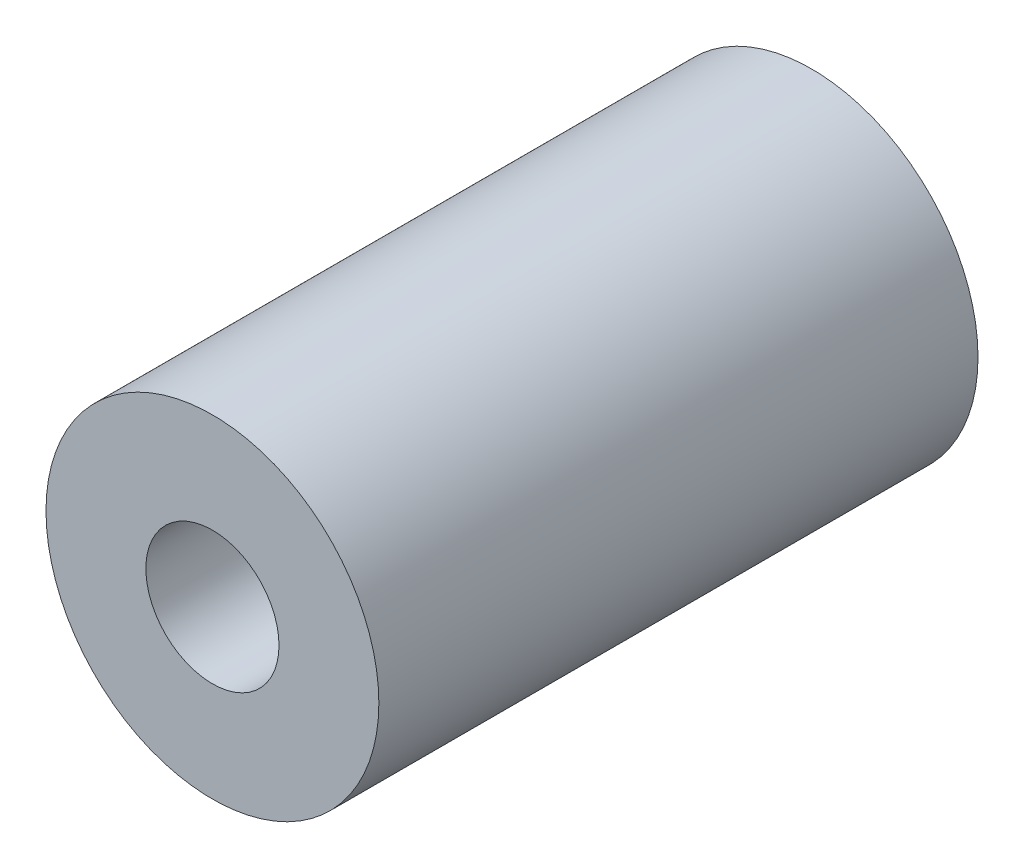
ISO-10303-21;
HEADER;
FILE_DESCRIPTION(('STEP AP214'),'2;1');
FILE_NAME('part.step','',(''),(''),'','','');
FILE_SCHEMA(('AUTOMOTIVE_DESIGN { 1 0 10303 214 1 1 1 1 }'));
ENDSEC;
DATA;
#1=APPLICATION_CONTEXT('core data for automotive mechanical design processes');
#2=APPLICATION_PROTOCOL_DEFINITION('international standard','automotive_design',2000,#1);
#3=PRODUCT_CONTEXT('',#1,'mechanical');
#4=PRODUCT('Part','Part','',(#3));
#5=PRODUCT_RELATED_PRODUCT_CATEGORY('part','',(#4));
#6=PRODUCT_DEFINITION_FORMATION('','',#4);
#7=PRODUCT_DEFINITION_CONTEXT('part definition',#1,'design');
#8=PRODUCT_DEFINITION('design','',#6,#7);
#9=PRODUCT_DEFINITION_SHAPE('','',#8);
#10=(LENGTH_UNIT() NAMED_UNIT(*) SI_UNIT(.MILLI.,.METRE.));
#11=(NAMED_UNIT(*) PLANE_ANGLE_UNIT() SI_UNIT($,.RADIAN.));
#12=(NAMED_UNIT(*) SI_UNIT($,.STERADIAN.) SOLID_ANGLE_UNIT());
#13=UNCERTAINTY_MEASURE_WITH_UNIT(LENGTH_MEASURE(1.E-05),#10,'distance_accuracy_value','');
#14=(GEOMETRIC_REPRESENTATION_CONTEXT(3) GLOBAL_UNCERTAINTY_ASSIGNED_CONTEXT((#13)) GLOBAL_UNIT_ASSIGNED_CONTEXT((#10,
#11,#12)) REPRESENTATION_CONTEXT('',''));
#15=CARTESIAN_POINT('',(0.,0.,0.));
#16=DIRECTION('',(0.,0.,1.));
#17=DIRECTION('',(1.,0.,0.));
#18=AXIS2_PLACEMENT_3D('',#15,#16,#17);
#19=CARTESIAN_POINT('',(0.,0.,54.));
#20=DIRECTION('',(0.,0.,1.));
#21=DIRECTION('',(1.,0.,0.));
#22=AXIS2_PLACEMENT_3D('',#19,#20,#21);
#23=PLANE('',#22);
#24=CARTESIAN_POINT('',(0.,0.,54.));
#25=DIRECTION('',(0.,0.,1.));
#26=DIRECTION('',(1.,0.,0.));
#27=AXIS2_PLACEMENT_3D('',#24,#25,#26);
#28=CIRCLE('',#27,15.);
#29=CARTESIAN_POINT('',(15.,0.,54.));
#30=VERTEX_POINT('',#29);
#31=EDGE_CURVE('E10',#30,#30,#28,.T.);
#32=ORIENTED_EDGE('',*,*,#31,.T.);
#33=EDGE_LOOP('',(#32));
#34=FACE_BOUND('',#33,.T.);
#35=CARTESIAN_POINT('',(0.,0.,54.));
#36=DIRECTION('',(0.,0.,1.));
#37=DIRECTION('',(1.,0.,0.));
#38=AXIS2_PLACEMENT_3D('',#35,#36,#37);
#39=CIRCLE('',#38,6.);
#40=CARTESIAN_POINT('',(6.,0.,54.));
#41=VERTEX_POINT('',#40);
#42=EDGE_CURVE('E45',#41,#41,#39,.T.);
#43=ORIENTED_EDGE('',*,*,#42,.F.);
#44=EDGE_LOOP('',(#43));
#45=FACE_BOUND('',#44,.T.);
#46=ADVANCED_FACE('F34',(#34,#45),#23,.T.);
#47=CARTESIAN_POINT('',(0.,0.,0.));
#48=DIRECTION('',(0.,0.,1.));
#49=DIRECTION('',(1.,0.,0.));
#50=AXIS2_PLACEMENT_3D('',#47,#48,#49);
#51=PLANE('',#50);
#52=CARTESIAN_POINT('',(0.,0.,0.));
#53=DIRECTION('',(0.,0.,1.));
#54=DIRECTION('',(1.,0.,0.));
#55=AXIS2_PLACEMENT_3D('',#52,#53,#54);
#56=CIRCLE('',#55,15.);
#57=CARTESIAN_POINT('',(15.,0.,0.));
#58=VERTEX_POINT('',#57);
#59=EDGE_CURVE('E38',#58,#58,#56,.T.);
#60=ORIENTED_EDGE('',*,*,#59,.F.);
#61=EDGE_LOOP('',(#60));
#62=FACE_BOUND('',#61,.T.);
#63=CARTESIAN_POINT('',(0.,0.,0.));
#64=DIRECTION('',(0.,0.,1.));
#65=DIRECTION('',(1.,0.,0.));
#66=AXIS2_PLACEMENT_3D('',#63,#64,#65);
#67=CIRCLE('',#66,6.);
#68=CARTESIAN_POINT('',(6.,0.,0.));
#69=VERTEX_POINT('',#68);
#70=EDGE_CURVE('E47',#69,#69,#67,.T.);
#71=ORIENTED_EDGE('',*,*,#70,.T.);
#72=EDGE_LOOP('',(#71));
#73=FACE_BOUND('',#72,.T.);
#74=ADVANCED_FACE('F57',(#62,#73),#51,.F.);
#75=CARTESIAN_POINT('',(0.,0.,54.));
#76=DIRECTION('',(0.,0.,-1.));
#77=DIRECTION('',(-1.,0.,0.));
#78=AXIS2_PLACEMENT_3D('',#75,#76,#77);
#79=CYLINDRICAL_SURFACE('',#78,15.);
#80=ORIENTED_EDGE('',*,*,#31,.F.);
#81=EDGE_LOOP('',(#80));
#82=FACE_BOUND('',#81,.T.);
#83=ORIENTED_EDGE('',*,*,#59,.T.);
#84=EDGE_LOOP('',(#83));
#85=FACE_BOUND('',#84,.T.);
#86=ADVANCED_FACE('F36',(#82,#85),#79,.T.);
#87=CARTESIAN_POINT('',(0.,0.,54.));
#88=DIRECTION('',(0.,0.,-1.));
#89=DIRECTION('',(-1.,0.,0.));
#90=AXIS2_PLACEMENT_3D('',#87,#88,#89);
#91=CYLINDRICAL_SURFACE('',#90,6.);
#92=ORIENTED_EDGE('',*,*,#42,.T.);
#93=EDGE_LOOP('',(#92));
#94=FACE_BOUND('',#93,.T.);
#95=ORIENTED_EDGE('',*,*,#70,.F.);
#96=EDGE_LOOP('',(#95));
#97=FACE_BOUND('',#96,.T.);
#98=ADVANCED_FACE('F53',(#94,#97),#91,.F.);
#99=CLOSED_SHELL('',(#46,#74,#86,#98));
#100=MANIFOLD_SOLID_BREP('B2',#99);
#101=ADVANCED_BREP_SHAPE_REPRESENTATION('',(#18,#100),#14);
#102=SHAPE_DEFINITION_REPRESENTATION(#9,#101);
ENDSEC;
END-ISO-10303-21;
